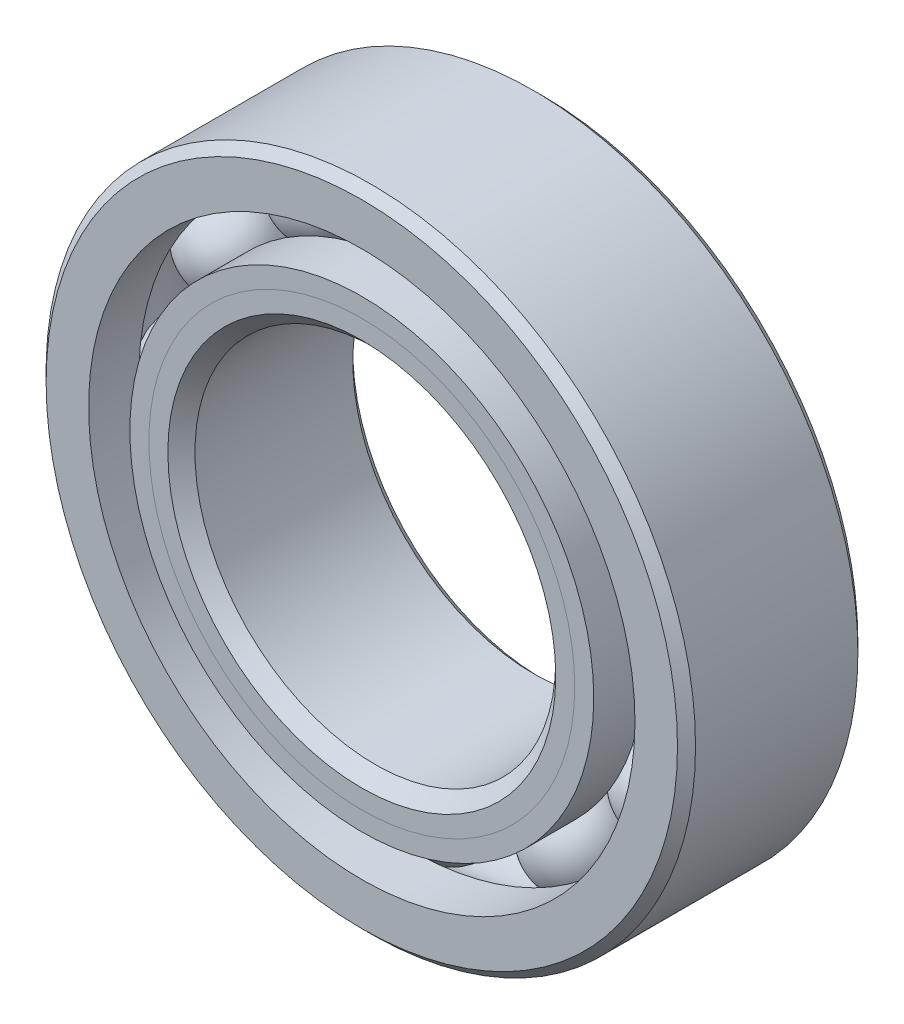
ISO-10303-21;
HEADER;
FILE_DESCRIPTION(('STEP AP214'),'2;1');
FILE_NAME('part.step','',(''),(''),'','','');
FILE_SCHEMA(('AUTOMOTIVE_DESIGN { 1 0 10303 214 1 1 1 1 }'));
ENDSEC;
DATA;
#1=APPLICATION_CONTEXT('core data for automotive mechanical design processes');
#2=APPLICATION_PROTOCOL_DEFINITION('international standard','automotive_design',2000,#1);
#3=PRODUCT_CONTEXT('',#1,'mechanical');
#4=PRODUCT('Part','Part','',(#3));
#5=PRODUCT_RELATED_PRODUCT_CATEGORY('part','',(#4));
#6=PRODUCT_DEFINITION_FORMATION('','',#4);
#7=PRODUCT_DEFINITION_CONTEXT('part definition',#1,'design');
#8=PRODUCT_DEFINITION('design','',#6,#7);
#9=PRODUCT_DEFINITION_SHAPE('','',#8);
#10=(LENGTH_UNIT() NAMED_UNIT(*) SI_UNIT(.MILLI.,.METRE.));
#11=(NAMED_UNIT(*) PLANE_ANGLE_UNIT() SI_UNIT($,.RADIAN.));
#12=(NAMED_UNIT(*) SI_UNIT($,.STERADIAN.) SOLID_ANGLE_UNIT());
#13=UNCERTAINTY_MEASURE_WITH_UNIT(LENGTH_MEASURE(1.E-05),#10,'distance_accuracy_value','');
#14=(GEOMETRIC_REPRESENTATION_CONTEXT(3) GLOBAL_UNCERTAINTY_ASSIGNED_CONTEXT((#13)) GLOBAL_UNIT_ASSIGNED_CONTEXT((#10,
#11,#12)) REPRESENTATION_CONTEXT('',''));
#15=CARTESIAN_POINT('',(0.,0.,0.));
#16=DIRECTION('',(0.,0.,1.));
#17=DIRECTION('',(1.,0.,0.));
#18=AXIS2_PLACEMENT_3D('',#15,#16,#17);
#19=CARTESIAN_POINT('',(-5.55624999999988,9.62370729955465,0.));
#20=DIRECTION('',(0.,0.,1.));
#21=DIRECTION('',(-0.499999999999989,0.866025403784445,0.));
#22=AXIS2_PLACEMENT_3D('',#19,#20,#21);
#23=SPHERICAL_SURFACE('',#22,1.9834848564108);
#24=CARTESIAN_POINT('',(-5.55624999999988,9.62370729955465,1.9834848564108));
#25=VERTEX_POINT('',#24);
#26=VERTEX_LOOP('',#25);
#27=FACE_BOUND('',#26,.T.);
#28=ADVANCED_FACE('F37',(#27),#23,.T.);
#29=CLOSED_SHELL('',(#28));
#30=MANIFOLD_SOLID_BREP('B2',#29);
#31=CARTESIAN_POINT('',(-9.62370729955451,5.55625000000011,0.));
#32=DIRECTION('',(0.,0.,1.));
#33=DIRECTION('',(-0.866025403784433,0.50000000000001,0.));
#34=AXIS2_PLACEMENT_3D('',#31,#32,#33);
#35=SPHERICAL_SURFACE('',#34,1.9834848564108);
#36=CARTESIAN_POINT('',(-9.62370729955451,5.55625000000011,1.9834848564108));
#37=VERTEX_POINT('',#36);
#38=VERTEX_LOOP('',#37);
#39=FACE_BOUND('',#38,.T.);
#40=ADVANCED_FACE('F68',(#39),#35,.T.);
#41=CLOSED_SHELL('',(#40));
#42=MANIFOLD_SOLID_BREP('B6',#41);
#43=CARTESIAN_POINT('',(-11.1125,1.16397259133683E-13,0.));
#44=DIRECTION('',(0.,0.,1.));
#45=DIRECTION('',(-1.,0.,0.));
#46=AXIS2_PLACEMENT_3D('',#43,#44,#45);
#47=SPHERICAL_SURFACE('',#46,1.9834848564108);
#48=CARTESIAN_POINT('',(-11.1125,1.16397259133683E-13,1.9834848564108));
#49=VERTEX_POINT('',#48);
#50=VERTEX_LOOP('',#49);
#51=FACE_BOUND('',#50,.T.);
#52=ADVANCED_FACE('F99',(#51),#47,.T.);
#53=CLOSED_SHELL('',(#52));
#54=MANIFOLD_SOLID_BREP('B33',#53);
#55=CARTESIAN_POINT('',(-9.62370729955463,-5.55624999999991,0.));
#56=DIRECTION('',(0.,0.,1.));
#57=DIRECTION('',(-0.866025403784443,-0.499999999999992,0.));
#58=AXIS2_PLACEMENT_3D('',#55,#56,#57);
#59=SPHERICAL_SURFACE('',#58,1.9834848564108);
#60=CARTESIAN_POINT('',(-9.62370729955463,-5.55624999999991,1.9834848564108));
#61=VERTEX_POINT('',#60);
#62=VERTEX_LOOP('',#61);
#63=FACE_BOUND('',#62,.T.);
#64=ADVANCED_FACE('F130',(#63),#59,.T.);
#65=CLOSED_SHELL('',(#64));
#66=MANIFOLD_SOLID_BREP('B64',#65);
#67=CARTESIAN_POINT('',(-5.55625000000008,-9.62370729955453,0.));
#68=DIRECTION('',(0.,0.,1.));
#69=DIRECTION('',(-0.500000000000007,-0.866025403784435,0.));
#70=AXIS2_PLACEMENT_3D('',#67,#68,#69);
#71=SPHERICAL_SURFACE('',#70,1.9834848564108);
#72=CARTESIAN_POINT('',(-5.55625000000008,-9.62370729955453,1.9834848564108));
#73=VERTEX_POINT('',#72);
#74=VERTEX_LOOP('',#73);
#75=FACE_BOUND('',#74,.T.);
#76=ADVANCED_FACE('F161',(#75),#71,.T.);
#77=CLOSED_SHELL('',(#76));
#78=MANIFOLD_SOLID_BREP('B95',#77);
#79=CARTESIAN_POINT('',(0.,-11.1125,0.));
#80=DIRECTION('',(0.,0.,1.));
#81=DIRECTION('',(0.,-1.,0.));
#82=AXIS2_PLACEMENT_3D('',#79,#80,#81);
#83=SPHERICAL_SURFACE('',#82,1.9834848564108);
#84=CARTESIAN_POINT('',(0.,-11.1125,1.9834848564108));
#85=VERTEX_POINT('',#84);
#86=VERTEX_LOOP('',#85);
#87=FACE_BOUND('',#86,.T.);
#88=ADVANCED_FACE('F192',(#87),#83,.T.);
#89=CLOSED_SHELL('',(#88));
#90=MANIFOLD_SOLID_BREP('B126',#89);
#91=CARTESIAN_POINT('',(5.55624999999994,-9.62370729955461,0.));
#92=DIRECTION('',(0.,0.,1.));
#93=DIRECTION('',(0.499999999999995,-0.866025403784442,0.));
#94=AXIS2_PLACEMENT_3D('',#91,#92,#93);
#95=SPHERICAL_SURFACE('',#94,1.9834848564108);
#96=CARTESIAN_POINT('',(5.55624999999994,-9.62370729955461,1.9834848564108));
#97=VERTEX_POINT('',#96);
#98=VERTEX_LOOP('',#97);
#99=FACE_BOUND('',#98,.T.);
#100=ADVANCED_FACE('F223',(#99),#95,.T.);
#101=CLOSED_SHELL('',(#100));
#102=MANIFOLD_SOLID_BREP('B157',#101);
#103=CARTESIAN_POINT('',(9.62370729955455,-5.55625000000005,0.));
#104=DIRECTION('',(0.,0.,1.));
#105=DIRECTION('',(0.866025403784436,-0.500000000000004,0.));
#106=AXIS2_PLACEMENT_3D('',#103,#104,#105);
#107=SPHERICAL_SURFACE('',#106,1.9834848564108);
#108=CARTESIAN_POINT('',(9.62370729955455,-5.55625000000005,1.9834848564108));
#109=VERTEX_POINT('',#108);
#110=VERTEX_LOOP('',#109);
#111=FACE_BOUND('',#110,.T.);
#112=ADVANCED_FACE('F254',(#111),#107,.T.);
#113=CLOSED_SHELL('',(#112));
#114=MANIFOLD_SOLID_BREP('B188',#113);
#115=CARTESIAN_POINT('',(11.1125,0.,0.));
#116=DIRECTION('',(0.,0.,1.));
#117=DIRECTION('',(1.,0.,0.));
#118=AXIS2_PLACEMENT_3D('',#115,#116,#117);
#119=SPHERICAL_SURFACE('',#118,1.9834848564108);
#120=CARTESIAN_POINT('',(11.1125,0.,1.9834848564108));
#121=VERTEX_POINT('',#120);
#122=VERTEX_LOOP('',#121);
#123=FACE_BOUND('',#122,.T.);
#124=ADVANCED_FACE('F285',(#123),#119,.T.);
#125=CLOSED_SHELL('',(#124));
#126=MANIFOLD_SOLID_BREP('B219',#125);
#127=CARTESIAN_POINT('',(9.62370729955459,5.55624999999998,0.));
#128=DIRECTION('',(0.,0.,1.));
#129=DIRECTION('',(0.86602540378444,0.499999999999998,0.));
#130=AXIS2_PLACEMENT_3D('',#127,#128,#129);
#131=SPHERICAL_SURFACE('',#130,1.9834848564108);
#132=CARTESIAN_POINT('',(9.62370729955459,5.55624999999998,1.9834848564108));
#133=VERTEX_POINT('',#132);
#134=VERTEX_LOOP('',#133);
#135=FACE_BOUND('',#134,.T.);
#136=ADVANCED_FACE('F316',(#135),#131,.T.);
#137=CLOSED_SHELL('',(#136));
#138=MANIFOLD_SOLID_BREP('B250',#137);
#139=CARTESIAN_POINT('',(5.55625000000001,9.62370729955457,0.));
#140=DIRECTION('',(0.,0.,1.));
#141=DIRECTION('',(0.500000000000001,0.866025403784438,0.));
#142=AXIS2_PLACEMENT_3D('',#139,#140,#141);
#143=SPHERICAL_SURFACE('',#142,1.9834848564108);
#144=CARTESIAN_POINT('',(5.55625000000001,9.62370729955457,1.9834848564108));
#145=VERTEX_POINT('',#144);
#146=VERTEX_LOOP('',#145);
#147=FACE_BOUND('',#146,.T.);
#148=ADVANCED_FACE('F347',(#147),#143,.T.);
#149=CLOSED_SHELL('',(#148));
#150=MANIFOLD_SOLID_BREP('B281',#149);
#151=CARTESIAN_POINT('',(0.,11.1125,0.));
#152=DIRECTION('',(0.,0.,1.));
#153=DIRECTION('',(0.,1.,0.));
#154=AXIS2_PLACEMENT_3D('',#151,#152,#153);
#155=SPHERICAL_SURFACE('',#154,1.9834848564108);
#156=CARTESIAN_POINT('',(0.,11.1125,1.9834848564108));
#157=VERTEX_POINT('',#156);
#158=VERTEX_LOOP('',#157);
#159=FACE_BOUND('',#158,.T.);
#160=ADVANCED_FACE('F380',(#159),#155,.T.);
#161=CLOSED_SHELL('',(#160));
#162=MANIFOLD_SOLID_BREP('B312',#161);
#163=CARTESIAN_POINT('',(0.,9.36930735732587,3.96875));
#164=DIRECTION('',(0.,0.,-1.));
#165=DIRECTION('',(-1.,0.,0.));
#166=AXIS2_PLACEMENT_3D('',#163,#164,#165);
#167=PLANE('',#166);
#168=CARTESIAN_POINT('',(0.,0.,3.96875));
#169=DIRECTION('',(0.,0.,1.));
#170=DIRECTION('',(1.,0.,0.));
#171=AXIS2_PLACEMENT_3D('',#168,#169,#170);
#172=CIRCLE('',#171,8.5332575717946);
#173=CARTESIAN_POINT('',(8.5332575717946,0.,3.96875));
#174=VERTEX_POINT('',#173);
#175=EDGE_CURVE('E434',#174,#174,#172,.T.);
#176=ORIENTED_EDGE('',*,*,#175,.F.);
#177=EDGE_LOOP('',(#176));
#178=FACE_BOUND('',#177,.T.);
#179=CARTESIAN_POINT('',(0.,0.,3.96875));
#180=DIRECTION('',(0.,0.,1.));
#181=DIRECTION('',(1.,0.,0.));
#182=AXIS2_PLACEMENT_3D('',#179,#180,#181);
#183=CIRCLE('',#182,9.36930735732587);
#184=CARTESIAN_POINT('',(9.36930735732587,0.,3.96875));
#185=VERTEX_POINT('',#184);
#186=EDGE_CURVE('E379',#185,#185,#183,.T.);
#187=ORIENTED_EDGE('',*,*,#186,.T.);
#188=EDGE_LOOP('',(#187));
#189=FACE_BOUND('',#188,.T.);
#190=ADVANCED_FACE('F400',(#178,#189),#167,.F.);
#191=CARTESIAN_POINT('',(0.,0.,3.13270021446873));
#192=DIRECTION('',(0.,0.,1.));
#193=DIRECTION('',(1.,0.,0.));
#194=AXIS2_PLACEMENT_3D('',#191,#192,#193);
#195=CONICAL_SURFACE('',#194,8.5332575717946,0.78539816339745);
#196=ORIENTED_EDGE('',*,*,#186,.F.);
#197=EDGE_LOOP('',(#196));
#198=FACE_BOUND('',#197,.T.);
#199=CARTESIAN_POINT('',(0.,0.,3.13270021446873));
#200=DIRECTION('',(0.,0.,1.));
#201=DIRECTION('',(1.,0.,0.));
#202=AXIS2_PLACEMENT_3D('',#199,#200,#201);
#203=CIRCLE('',#202,8.5332575717946);
#204=CARTESIAN_POINT('',(8.5332575717946,0.,3.13270021446873));
#205=VERTEX_POINT('',#204);
#206=EDGE_CURVE('E406',#205,#205,#203,.T.);
#207=ORIENTED_EDGE('',*,*,#206,.T.);
#208=EDGE_LOOP('',(#207));
#209=FACE_BOUND('',#208,.T.);
#210=ADVANCED_FACE('F441',(#198,#209),#195,.T.);
#211=CARTESIAN_POINT('',(0.,0.,3.96875));
#212=DIRECTION('',(0.,0.,1.));
#213=DIRECTION('',(1.,0.,0.));
#214=AXIS2_PLACEMENT_3D('',#211,#212,#213);
#215=CYLINDRICAL_SURFACE('',#214,8.5332575717946);
#216=ORIENTED_EDGE('',*,*,#206,.F.);
#217=EDGE_LOOP('',(#216));
#218=FACE_BOUND('',#217,.T.);
#219=CARTESIAN_POINT('',(0.,0.,0.));
#220=DIRECTION('',(0.,0.,1.));
#221=DIRECTION('',(1.,0.,0.));
#222=AXIS2_PLACEMENT_3D('',#219,#220,#221);
#223=CIRCLE('',#222,8.5332575717946);
#224=CARTESIAN_POINT('',(8.5332575717946,0.,0.));
#225=VERTEX_POINT('',#224);
#226=EDGE_CURVE('E410',#225,#225,#223,.T.);
#227=ORIENTED_EDGE('',*,*,#226,.T.);
#228=EDGE_LOOP('',(#227));
#229=FACE_BOUND('',#228,.T.);
#230=ADVANCED_FACE('F445',(#218,#229),#215,.T.);
#231=CARTESIAN_POINT('',(0.,8.5332575717946,0.));
#232=DIRECTION('',(0.,0.,-1.));
#233=DIRECTION('',(-1.,0.,0.));
#234=AXIS2_PLACEMENT_3D('',#231,#232,#233);
#235=PLANE('',#234);
#236=ORIENTED_EDGE('',*,*,#226,.F.);
#237=EDGE_LOOP('',(#236));
#238=FACE_BOUND('',#237,.T.);
#239=CARTESIAN_POINT('',(0.,0.,0.));
#240=DIRECTION('',(0.,0.,1.));
#241=DIRECTION('',(1.,0.,0.));
#242=AXIS2_PLACEMENT_3D('',#239,#240,#241);
#243=CIRCLE('',#242,9.1290151435892);
#244=CARTESIAN_POINT('',(9.1290151435892,0.,0.));
#245=VERTEX_POINT('',#244);
#246=EDGE_CURVE('E414',#245,#245,#243,.T.);
#247=ORIENTED_EDGE('',*,*,#246,.T.);
#248=EDGE_LOOP('',(#247));
#249=FACE_BOUND('',#248,.T.);
#250=ADVANCED_FACE('F450',(#238,#249),#235,.F.);
#251=CARTESIAN_POINT('',(0.,0.,0.));
#252=DIRECTION('',(0.,0.,1.));
#253=DIRECTION('',(1.,0.,0.));
#254=AXIS2_PLACEMENT_3D('',#251,#252,#253);
#255=TOROIDAL_SURFACE('',#254,11.1125,1.9834848564108);
#256=ORIENTED_EDGE('',*,*,#246,.F.);
#257=EDGE_LOOP('',(#256));
#258=FACE_BOUND('',#257,.T.);
#259=CARTESIAN_POINT('',(0.,0.,-1.76388888888889));
#260=DIRECTION('',(0.,0.,1.));
#261=DIRECTION('',(1.,0.,0.));
#262=AXIS2_PLACEMENT_3D('',#259,#260,#261);
#263=CIRCLE('',#262,10.2053571428571);
#264=CARTESIAN_POINT('',(10.2053571428571,0.,-1.76388888888889));
#265=VERTEX_POINT('',#264);
#266=EDGE_CURVE('E419',#265,#265,#263,.T.);
#267=ORIENTED_EDGE('',*,*,#266,.T.);
#268=EDGE_LOOP('',(#267));
#269=FACE_BOUND('',#268,.T.);
#270=ADVANCED_FACE('F456',(#258,#269),#255,.F.);
#271=CARTESIAN_POINT('',(0.,0.,3.96875));
#272=DIRECTION('',(0.,0.,1.));
#273=DIRECTION('',(1.,0.,0.));
#274=AXIS2_PLACEMENT_3D('',#271,#272,#273);
#275=CYLINDRICAL_SURFACE('',#274,10.2053571428571);
#276=ORIENTED_EDGE('',*,*,#266,.F.);
#277=EDGE_LOOP('',(#276));
#278=FACE_BOUND('',#277,.T.);
#279=CARTESIAN_POINT('',(0.,0.,-3.96875));
#280=DIRECTION('',(0.,0.,1.));
#281=DIRECTION('',(1.,0.,0.));
#282=AXIS2_PLACEMENT_3D('',#279,#280,#281);
#283=CIRCLE('',#282,10.2053571428571);
#284=CARTESIAN_POINT('',(10.2053571428571,0.,-3.96875));
#285=VERTEX_POINT('',#284);
#286=EDGE_CURVE('E422',#285,#285,#283,.T.);
#287=ORIENTED_EDGE('',*,*,#286,.T.);
#288=EDGE_LOOP('',(#287));
#289=FACE_BOUND('',#288,.T.);
#290=ADVANCED_FACE('F460',(#278,#289),#275,.T.);
#291=CARTESIAN_POINT('',(0.,8.334375,-3.96875));
#292=DIRECTION('',(0.,0.,1.));
#293=DIRECTION('',(1.,0.,0.));
#294=AXIS2_PLACEMENT_3D('',#291,#292,#293);
#295=PLANE('',#294);
#296=ORIENTED_EDGE('',*,*,#286,.F.);
#297=EDGE_LOOP('',(#296));
#298=FACE_BOUND('',#297,.T.);
#299=CARTESIAN_POINT('',(0.,0.,-3.96875));
#300=DIRECTION('',(0.,0.,1.));
#301=DIRECTION('',(1.,0.,0.));
#302=AXIS2_PLACEMENT_3D('',#299,#300,#301);
#303=CIRCLE('',#302,8.334375);
#304=CARTESIAN_POINT('',(8.334375,0.,-3.96875));
#305=VERTEX_POINT('',#304);
#306=EDGE_CURVE('E425',#305,#305,#303,.T.);
#307=ORIENTED_EDGE('',*,*,#306,.T.);
#308=EDGE_LOOP('',(#307));
#309=FACE_BOUND('',#308,.T.);
#310=ADVANCED_FACE('F464',(#298,#309),#295,.F.);
#311=CARTESIAN_POINT('',(0.,0.,-3.571875));
#312=DIRECTION('',(0.,0.,-1.));
#313=DIRECTION('',(-1.,0.,0.));
#314=AXIS2_PLACEMENT_3D('',#311,#312,#313);
#315=CONICAL_SURFACE('',#314,7.9375,0.78539816339745);
#316=ORIENTED_EDGE('',*,*,#306,.F.);
#317=EDGE_LOOP('',(#316));
#318=FACE_BOUND('',#317,.T.);
#319=CARTESIAN_POINT('',(0.,0.,-3.571875));
#320=DIRECTION('',(0.,0.,1.));
#321=DIRECTION('',(1.,0.,0.));
#322=AXIS2_PLACEMENT_3D('',#319,#320,#321);
#323=CIRCLE('',#322,7.9375);
#324=CARTESIAN_POINT('',(7.9375,0.,-3.571875));
#325=VERTEX_POINT('',#324);
#326=EDGE_CURVE('E428',#325,#325,#323,.T.);
#327=ORIENTED_EDGE('',*,*,#326,.T.);
#328=EDGE_LOOP('',(#327));
#329=FACE_BOUND('',#328,.T.);
#330=ADVANCED_FACE('F468',(#318,#329),#315,.F.);
#331=CARTESIAN_POINT('',(0.,0.,3.96875));
#332=DIRECTION('',(0.,0.,1.));
#333=DIRECTION('',(1.,0.,0.));
#334=AXIS2_PLACEMENT_3D('',#331,#332,#333);
#335=CYLINDRICAL_SURFACE('',#334,7.9375);
#336=ORIENTED_EDGE('',*,*,#326,.F.);
#337=EDGE_LOOP('',(#336));
#338=FACE_BOUND('',#337,.T.);
#339=CARTESIAN_POINT('',(0.,0.,3.3729924282054));
#340=DIRECTION('',(0.,0.,1.));
#341=DIRECTION('',(1.,0.,0.));
#342=AXIS2_PLACEMENT_3D('',#339,#340,#341);
#343=CIRCLE('',#342,7.9375);
#344=CARTESIAN_POINT('',(7.9375,0.,3.3729924282054));
#345=VERTEX_POINT('',#344);
#346=EDGE_CURVE('E431',#345,#345,#343,.T.);
#347=ORIENTED_EDGE('',*,*,#346,.T.);
#348=EDGE_LOOP('',(#347));
#349=FACE_BOUND('',#348,.T.);
#350=ADVANCED_FACE('F472',(#338,#349),#335,.F.);
#351=CARTESIAN_POINT('',(0.,0.,3.96875));
#352=DIRECTION('',(0.,0.,1.));
#353=DIRECTION('',(1.,0.,0.));
#354=AXIS2_PLACEMENT_3D('',#351,#352,#353);
#355=CONICAL_SURFACE('',#354,8.5332575717946,0.78539816339745);
#356=ORIENTED_EDGE('',*,*,#346,.F.);
#357=EDGE_LOOP('',(#356));
#358=FACE_BOUND('',#357,.T.);
#359=ORIENTED_EDGE('',*,*,#175,.T.);
#360=EDGE_LOOP('',(#359));
#361=FACE_BOUND('',#360,.T.);
#362=ADVANCED_FACE('F438',(#358,#361),#355,.F.);
#363=CLOSED_SHELL('',(#190,#210,#230,#250,#270,#290,#310,#330,#350,#362));
#364=MANIFOLD_SOLID_BREP('B343',#363);
#365=CARTESIAN_POINT('',(0.,10.2053571428571,3.96875));
#366=DIRECTION('',(0.,0.,-1.));
#367=DIRECTION('',(-1.,0.,0.));
#368=AXIS2_PLACEMENT_3D('',#365,#366,#367);
#369=PLANE('',#368);
#370=CARTESIAN_POINT('',(0.,0.,3.96875));
#371=DIRECTION('',(0.,0.,1.));
#372=DIRECTION('',(1.,0.,0.));
#373=AXIS2_PLACEMENT_3D('',#370,#371,#372);
#374=CIRCLE('',#373,9.36930735732587);
#375=CARTESIAN_POINT('',(9.36930735732587,0.,3.96875));
#376=VERTEX_POINT('',#375);
#377=EDGE_CURVE('E399',#376,#376,#374,.T.);
#378=ORIENTED_EDGE('',*,*,#377,.F.);
#379=EDGE_LOOP('',(#378));
#380=FACE_BOUND('',#379,.T.);
#381=CARTESIAN_POINT('',(0.,0.,3.96875));
#382=DIRECTION('',(0.,0.,1.));
#383=DIRECTION('',(1.,0.,0.));
#384=AXIS2_PLACEMENT_3D('',#381,#382,#383);
#385=CIRCLE('',#384,10.2053571428571);
#386=CARTESIAN_POINT('',(10.2053571428571,0.,3.96875));
#387=VERTEX_POINT('',#386);
#388=EDGE_CURVE('E580',#387,#387,#385,.T.);
#389=ORIENTED_EDGE('',*,*,#388,.T.);
#390=EDGE_LOOP('',(#389));
#391=FACE_BOUND('',#390,.T.);
#392=ADVANCED_FACE('F558',(#380,#391),#369,.F.);
#393=CARTESIAN_POINT('',(0.,0.,3.96875));
#394=DIRECTION('',(0.,0.,1.));
#395=DIRECTION('',(1.,0.,0.));
#396=AXIS2_PLACEMENT_3D('',#393,#394,#395);
#397=CONICAL_SURFACE('',#396,9.36930735732587,0.78539816339745);
#398=CARTESIAN_POINT('',(0.,0.,3.13270021446873));
#399=DIRECTION('',(0.,0.,1.));
#400=DIRECTION('',(1.,0.,0.));
#401=AXIS2_PLACEMENT_3D('',#398,#399,#400);
#402=CIRCLE('',#401,8.5332575717946);
#403=CARTESIAN_POINT('',(8.5332575717946,0.,3.13270021446873));
#404=VERTEX_POINT('',#403);
#405=EDGE_CURVE('E564',#404,#404,#402,.T.);
#406=ORIENTED_EDGE('',*,*,#405,.F.);
#407=EDGE_LOOP('',(#406));
#408=FACE_BOUND('',#407,.T.);
#409=ORIENTED_EDGE('',*,*,#377,.T.);
#410=EDGE_LOOP('',(#409));
#411=FACE_BOUND('',#410,.T.);
#412=ADVANCED_FACE('F605',(#408,#411),#397,.F.);
#413=CARTESIAN_POINT('',(0.,0.,3.96875));
#414=DIRECTION('',(0.,0.,1.));
#415=DIRECTION('',(1.,0.,0.));
#416=AXIS2_PLACEMENT_3D('',#413,#414,#415);
#417=CYLINDRICAL_SURFACE('',#416,8.5332575717946);
#418=CARTESIAN_POINT('',(0.,0.,0.));
#419=DIRECTION('',(0.,0.,1.));
#420=DIRECTION('',(1.,0.,0.));
#421=AXIS2_PLACEMENT_3D('',#418,#419,#420);
#422=CIRCLE('',#421,8.5332575717946);
#423=CARTESIAN_POINT('',(8.5332575717946,0.,0.));
#424=VERTEX_POINT('',#423);
#425=EDGE_CURVE('E568',#424,#424,#422,.T.);
#426=ORIENTED_EDGE('',*,*,#425,.F.);
#427=EDGE_LOOP('',(#426));
#428=FACE_BOUND('',#427,.T.);
#429=ORIENTED_EDGE('',*,*,#405,.T.);
#430=EDGE_LOOP('',(#429));
#431=FACE_BOUND('',#430,.T.);
#432=ADVANCED_FACE('F600',(#428,#431),#417,.F.);
#433=CARTESIAN_POINT('',(0.,8.5332575717946,0.));
#434=DIRECTION('',(0.,0.,1.));
#435=DIRECTION('',(1.,0.,0.));
#436=AXIS2_PLACEMENT_3D('',#433,#434,#435);
#437=PLANE('',#436);
#438=CARTESIAN_POINT('',(0.,0.,0.));
#439=DIRECTION('',(0.,0.,1.));
#440=DIRECTION('',(1.,0.,0.));
#441=AXIS2_PLACEMENT_3D('',#438,#439,#440);
#442=CIRCLE('',#441,9.1290151435892);
#443=CARTESIAN_POINT('',(9.1290151435892,0.,0.));
#444=VERTEX_POINT('',#443);
#445=EDGE_CURVE('E572',#444,#444,#442,.T.);
#446=ORIENTED_EDGE('',*,*,#445,.F.);
#447=EDGE_LOOP('',(#446));
#448=FACE_BOUND('',#447,.T.);
#449=ORIENTED_EDGE('',*,*,#425,.T.);
#450=EDGE_LOOP('',(#449));
#451=FACE_BOUND('',#450,.T.);
#452=ADVANCED_FACE('F594',(#448,#451),#437,.F.);
#453=CARTESIAN_POINT('',(0.,0.,0.));
#454=DIRECTION('',(0.,0.,1.));
#455=DIRECTION('',(1.,0.,0.));
#456=AXIS2_PLACEMENT_3D('',#453,#454,#455);
#457=TOROIDAL_SURFACE('',#456,11.1125,1.9834848564108);
#458=CARTESIAN_POINT('',(0.,0.,1.76388888888889));
#459=DIRECTION('',(0.,0.,1.));
#460=DIRECTION('',(1.,0.,0.));
#461=AXIS2_PLACEMENT_3D('',#458,#459,#460);
#462=CIRCLE('',#461,10.2053571428571);
#463=CARTESIAN_POINT('',(10.2053571428571,0.,1.76388888888889));
#464=VERTEX_POINT('',#463);
#465=EDGE_CURVE('E577',#464,#464,#462,.T.);
#466=ORIENTED_EDGE('',*,*,#465,.F.);
#467=EDGE_LOOP('',(#466));
#468=FACE_BOUND('',#467,.T.);
#469=ORIENTED_EDGE('',*,*,#445,.T.);
#470=EDGE_LOOP('',(#469));
#471=FACE_BOUND('',#470,.T.);
#472=ADVANCED_FACE('F588',(#468,#471),#457,.F.);
#473=CARTESIAN_POINT('',(0.,0.,3.96875));
#474=DIRECTION('',(0.,0.,1.));
#475=DIRECTION('',(1.,0.,0.));
#476=AXIS2_PLACEMENT_3D('',#473,#474,#475);
#477=CYLINDRICAL_SURFACE('',#476,10.2053571428571);
#478=ORIENTED_EDGE('',*,*,#388,.F.);
#479=EDGE_LOOP('',(#478));
#480=FACE_BOUND('',#479,.T.);
#481=ORIENTED_EDGE('',*,*,#465,.T.);
#482=EDGE_LOOP('',(#481));
#483=FACE_BOUND('',#482,.T.);
#484=ADVANCED_FACE('F585',(#480,#483),#477,.T.);
#485=CLOSED_SHELL('',(#392,#412,#432,#452,#472,#484));
#486=MANIFOLD_SOLID_BREP('B374',#485);
#487=CARTESIAN_POINT('',(0.,0.,3.571875));
#488=DIRECTION('',(0.,0.,-1.));
#489=DIRECTION('',(-1.,0.,0.));
#490=AXIS2_PLACEMENT_3D('',#487,#488,#489);
#491=CONICAL_SURFACE('',#490,14.2875,0.785398163397449);
#492=CARTESIAN_POINT('',(0.,0.,3.96875));
#493=DIRECTION('',(0.,0.,1.));
#494=DIRECTION('',(1.,0.,0.));
#495=AXIS2_PLACEMENT_3D('',#492,#493,#494);
#496=CIRCLE('',#495,13.890625);
#497=CARTESIAN_POINT('',(13.890625,0.,3.96875));
#498=VERTEX_POINT('',#497);
#499=EDGE_CURVE('E677',#498,#498,#496,.T.);
#500=ORIENTED_EDGE('',*,*,#499,.F.);
#501=EDGE_LOOP('',(#500));
#502=FACE_BOUND('',#501,.T.);
#503=CARTESIAN_POINT('',(0.,0.,3.571875));
#504=DIRECTION('',(0.,0.,1.));
#505=DIRECTION('',(1.,0.,0.));
#506=AXIS2_PLACEMENT_3D('',#503,#504,#505);
#507=CIRCLE('',#506,14.2875);
#508=CARTESIAN_POINT('',(14.2875,0.,3.571875));
#509=VERTEX_POINT('',#508);
#510=EDGE_CURVE('E557',#509,#509,#507,.T.);
#511=ORIENTED_EDGE('',*,*,#510,.T.);
#512=EDGE_LOOP('',(#511));
#513=FACE_BOUND('',#512,.T.);
#514=ADVANCED_FACE('F649',(#502,#513),#491,.T.);
#515=CARTESIAN_POINT('',(0.,0.,3.96875));
#516=DIRECTION('',(0.,0.,1.));
#517=DIRECTION('',(1.,0.,0.));
#518=AXIS2_PLACEMENT_3D('',#515,#516,#517);
#519=CYLINDRICAL_SURFACE('',#518,14.2875);
#520=ORIENTED_EDGE('',*,*,#510,.F.);
#521=EDGE_LOOP('',(#520));
#522=FACE_BOUND('',#521,.T.);
#523=CARTESIAN_POINT('',(0.,0.,-3.571875));
#524=DIRECTION('',(0.,0.,1.));
#525=DIRECTION('',(1.,0.,0.));
#526=AXIS2_PLACEMENT_3D('',#523,#524,#525);
#527=CIRCLE('',#526,14.2875);
#528=CARTESIAN_POINT('',(14.2875,0.,-3.571875));
#529=VERTEX_POINT('',#528);
#530=EDGE_CURVE('E655',#529,#529,#527,.T.);
#531=ORIENTED_EDGE('',*,*,#530,.T.);
#532=EDGE_LOOP('',(#531));
#533=FACE_BOUND('',#532,.T.);
#534=ADVANCED_FACE('F684',(#522,#533),#519,.T.);
#535=CARTESIAN_POINT('',(0.,0.,-3.96875));
#536=DIRECTION('',(0.,0.,1.));
#537=DIRECTION('',(1.,0.,0.));
#538=AXIS2_PLACEMENT_3D('',#535,#536,#537);
#539=CONICAL_SURFACE('',#538,13.890625,0.785398163397448);
#540=ORIENTED_EDGE('',*,*,#530,.F.);
#541=EDGE_LOOP('',(#540));
#542=FACE_BOUND('',#541,.T.);
#543=CARTESIAN_POINT('',(0.,0.,-3.96875));
#544=DIRECTION('',(0.,0.,1.));
#545=DIRECTION('',(1.,0.,0.));
#546=AXIS2_PLACEMENT_3D('',#543,#544,#545);
#547=CIRCLE('',#546,13.890625);
#548=CARTESIAN_POINT('',(13.890625,0.,-3.96875));
#549=VERTEX_POINT('',#548);
#550=EDGE_CURVE('E659',#549,#549,#547,.T.);
#551=ORIENTED_EDGE('',*,*,#550,.T.);
#552=EDGE_LOOP('',(#551));
#553=FACE_BOUND('',#552,.T.);
#554=ADVANCED_FACE('F688',(#542,#553),#539,.T.);
#555=CARTESIAN_POINT('',(0.,13.890625,-3.96875));
#556=DIRECTION('',(0.,0.,1.));
#557=DIRECTION('',(1.,0.,0.));
#558=AXIS2_PLACEMENT_3D('',#555,#556,#557);
#559=PLANE('',#558);
#560=ORIENTED_EDGE('',*,*,#550,.F.);
#561=EDGE_LOOP('',(#560));
#562=FACE_BOUND('',#561,.T.);
#563=CARTESIAN_POINT('',(0.,0.,-3.96875));
#564=DIRECTION('',(0.,0.,1.));
#565=DIRECTION('',(1.,0.,0.));
#566=AXIS2_PLACEMENT_3D('',#563,#564,#565);
#567=CIRCLE('',#566,12.0196428571429);
#568=CARTESIAN_POINT('',(12.0196428571429,0.,-3.96875));
#569=VERTEX_POINT('',#568);
#570=EDGE_CURVE('E663',#569,#569,#567,.T.);
#571=ORIENTED_EDGE('',*,*,#570,.T.);
#572=EDGE_LOOP('',(#571));
#573=FACE_BOUND('',#572,.T.);
#574=ADVANCED_FACE('F693',(#562,#573),#559,.F.);
#575=CARTESIAN_POINT('',(0.,0.,3.96875));
#576=DIRECTION('',(0.,0.,1.));
#577=DIRECTION('',(1.,0.,0.));
#578=AXIS2_PLACEMENT_3D('',#575,#576,#577);
#579=CYLINDRICAL_SURFACE('',#578,12.0196428571429);
#580=ORIENTED_EDGE('',*,*,#570,.F.);
#581=EDGE_LOOP('',(#580));
#582=FACE_BOUND('',#581,.T.);
#583=CARTESIAN_POINT('',(0.,0.,-1.76388888888889));
#584=DIRECTION('',(0.,0.,1.));
#585=DIRECTION('',(1.,0.,0.));
#586=AXIS2_PLACEMENT_3D('',#583,#584,#585);
#587=CIRCLE('',#586,12.0196428571429);
#588=CARTESIAN_POINT('',(12.0196428571429,0.,-1.76388888888889));
#589=VERTEX_POINT('',#588);
#590=EDGE_CURVE('E668',#589,#589,#587,.T.);
#591=ORIENTED_EDGE('',*,*,#590,.T.);
#592=EDGE_LOOP('',(#591));
#593=FACE_BOUND('',#592,.T.);
#594=ADVANCED_FACE('F699',(#582,#593),#579,.F.);
#595=CARTESIAN_POINT('',(0.,0.,0.));
#596=DIRECTION('',(0.,0.,1.));
#597=DIRECTION('',(1.,0.,0.));
#598=AXIS2_PLACEMENT_3D('',#595,#596,#597);
#599=TOROIDAL_SURFACE('',#598,11.1125,1.9834848564108);
#600=ORIENTED_EDGE('',*,*,#590,.F.);
#601=EDGE_LOOP('',(#600));
#602=FACE_BOUND('',#601,.T.);
#603=CARTESIAN_POINT('',(0.,0.,1.76388888888889));
#604=DIRECTION('',(0.,0.,1.));
#605=DIRECTION('',(1.,0.,0.));
#606=AXIS2_PLACEMENT_3D('',#603,#604,#605);
#607=CIRCLE('',#606,12.0196428571429);
#608=CARTESIAN_POINT('',(12.0196428571429,0.,1.76388888888889));
#609=VERTEX_POINT('',#608);
#610=EDGE_CURVE('E671',#609,#609,#607,.T.);
#611=ORIENTED_EDGE('',*,*,#610,.T.);
#612=EDGE_LOOP('',(#611));
#613=FACE_BOUND('',#612,.T.);
#614=ADVANCED_FACE('F703',(#602,#613),#599,.F.);
#615=CARTESIAN_POINT('',(0.,0.,3.96875));
#616=DIRECTION('',(0.,0.,1.));
#617=DIRECTION('',(1.,0.,0.));
#618=AXIS2_PLACEMENT_3D('',#615,#616,#617);
#619=CYLINDRICAL_SURFACE('',#618,12.0196428571429);
#620=ORIENTED_EDGE('',*,*,#610,.F.);
#621=EDGE_LOOP('',(#620));
#622=FACE_BOUND('',#621,.T.);
#623=CARTESIAN_POINT('',(0.,0.,3.96875));
#624=DIRECTION('',(0.,0.,1.));
#625=DIRECTION('',(1.,0.,0.));
#626=AXIS2_PLACEMENT_3D('',#623,#624,#625);
#627=CIRCLE('',#626,12.0196428571429);
#628=CARTESIAN_POINT('',(12.0196428571429,0.,3.96875));
#629=VERTEX_POINT('',#628);
#630=EDGE_CURVE('E674',#629,#629,#627,.T.);
#631=ORIENTED_EDGE('',*,*,#630,.T.);
#632=EDGE_LOOP('',(#631));
#633=FACE_BOUND('',#632,.T.);
#634=ADVANCED_FACE('F707',(#622,#633),#619,.F.);
#635=CARTESIAN_POINT('',(0.,13.890625,3.96875));
#636=DIRECTION('',(0.,0.,-1.));
#637=DIRECTION('',(-1.,0.,0.));
#638=AXIS2_PLACEMENT_3D('',#635,#636,#637);
#639=PLANE('',#638);
#640=ORIENTED_EDGE('',*,*,#630,.F.);
#641=EDGE_LOOP('',(#640));
#642=FACE_BOUND('',#641,.T.);
#643=ORIENTED_EDGE('',*,*,#499,.T.);
#644=EDGE_LOOP('',(#643));
#645=FACE_BOUND('',#644,.T.);
#646=ADVANCED_FACE('F681',(#642,#645),#639,.F.);
#647=CLOSED_SHELL('',(#514,#534,#554,#574,#594,#614,#634,#646));
#648=MANIFOLD_SOLID_BREP('B394',#647);
#649=ADVANCED_BREP_SHAPE_REPRESENTATION('',(#18,#30,#42,#54,#66,#78,#90,#102,#114,#126,#138,
#150,#162,#364,#486,#648),#14);
#650=SHAPE_DEFINITION_REPRESENTATION(#9,#649);
ENDSEC;
END-ISO-10303-21;
